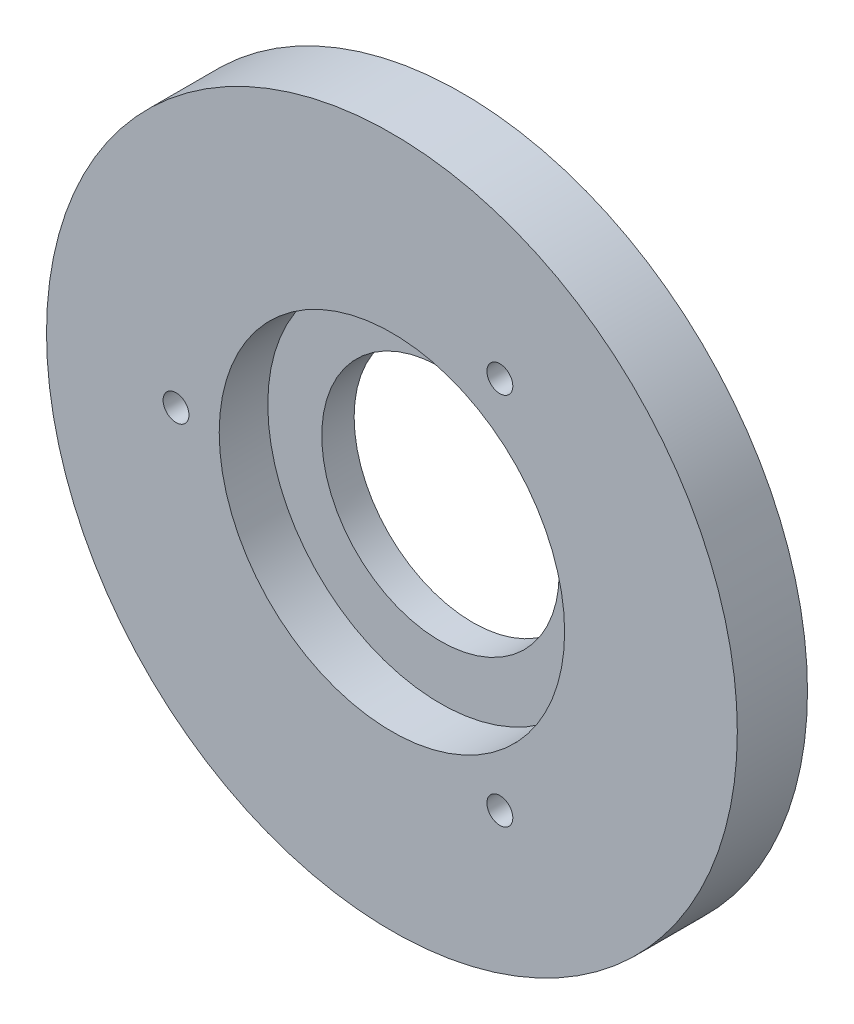
ISO-10303-21;
HEADER;
FILE_DESCRIPTION(('STEP AP214'),'2;1');
FILE_NAME('part.step','',(''),(''),'','','');
FILE_SCHEMA(('AUTOMOTIVE_DESIGN { 1 0 10303 214 1 1 1 1 }'));
ENDSEC;
DATA;
#1=APPLICATION_CONTEXT('core data for automotive mechanical design processes');
#2=APPLICATION_PROTOCOL_DEFINITION('international standard','automotive_design',2000,#1);
#3=PRODUCT_CONTEXT('',#1,'mechanical');
#4=PRODUCT('Part','Part','',(#3));
#5=PRODUCT_RELATED_PRODUCT_CATEGORY('part','',(#4));
#6=PRODUCT_DEFINITION_FORMATION('','',#4);
#7=PRODUCT_DEFINITION_CONTEXT('part definition',#1,'design');
#8=PRODUCT_DEFINITION('design','',#6,#7);
#9=PRODUCT_DEFINITION_SHAPE('','',#8);
#10=(LENGTH_UNIT() NAMED_UNIT(*) SI_UNIT(.MILLI.,.METRE.));
#11=(NAMED_UNIT(*) PLANE_ANGLE_UNIT() SI_UNIT($,.RADIAN.));
#12=(NAMED_UNIT(*) SI_UNIT($,.STERADIAN.) SOLID_ANGLE_UNIT());
#13=UNCERTAINTY_MEASURE_WITH_UNIT(LENGTH_MEASURE(1.E-05),#10,'distance_accuracy_value','');
#14=(GEOMETRIC_REPRESENTATION_CONTEXT(3) GLOBAL_UNCERTAINTY_ASSIGNED_CONTEXT((#13)) GLOBAL_UNIT_ASSIGNED_CONTEXT((#10,
#11,#12)) REPRESENTATION_CONTEXT('',''));
#15=CARTESIAN_POINT('',(0.,0.,0.));
#16=DIRECTION('',(0.,0.,1.));
#17=DIRECTION('',(1.,0.,0.));
#18=AXIS2_PLACEMENT_3D('',#15,#16,#17);
#19=CARTESIAN_POINT('',(0.,0.,9.5));
#20=DIRECTION('',(0.,0.,-1.));
#21=DIRECTION('',(-1.,0.,0.));
#22=AXIS2_PLACEMENT_3D('',#19,#20,#21);
#23=CYLINDRICAL_SURFACE('',#22,6.);
#24=CARTESIAN_POINT('',(0.,0.,9.5));
#25=DIRECTION('',(0.,0.,1.));
#26=DIRECTION('',(1.,0.,0.));
#27=AXIS2_PLACEMENT_3D('',#24,#25,#26);
#28=CIRCLE('',#27,6.);
#29=CARTESIAN_POINT('',(6.,0.,9.5));
#30=VERTEX_POINT('',#29);
#31=EDGE_CURVE('E10',#30,#30,#28,.T.);
#32=ORIENTED_EDGE('',*,*,#31,.F.);
#33=EDGE_LOOP('',(#32));
#34=FACE_BOUND('',#33,.T.);
#35=CARTESIAN_POINT('',(0.,0.,9.));
#36=DIRECTION('',(0.,0.,-1.));
#37=DIRECTION('',(-1.,0.,0.));
#38=AXIS2_PLACEMENT_3D('',#35,#36,#37);
#39=CIRCLE('',#38,6.);
#40=CARTESIAN_POINT('',(-6.,0.,9.));
#41=VERTEX_POINT('',#40);
#42=EDGE_CURVE('E63',#41,#41,#39,.T.);
#43=ORIENTED_EDGE('',*,*,#42,.F.);
#44=EDGE_LOOP('',(#43));
#45=FACE_BOUND('',#44,.T.);
#46=ADVANCED_FACE('F36',(#34,#45),#23,.T.);
#47=CARTESIAN_POINT('',(0.,0.,12.75));
#48=DIRECTION('',(0.,0.,-1.));
#49=DIRECTION('',(-1.,0.,0.));
#50=AXIS2_PLACEMENT_3D('',#47,#48,#49);
#51=CYLINDRICAL_SURFACE('',#50,16.);
#52=CARTESIAN_POINT('',(0.,0.,12.75));
#53=DIRECTION('',(0.,0.,1.));
#54=DIRECTION('',(1.,0.,0.));
#55=AXIS2_PLACEMENT_3D('',#52,#53,#54);
#56=CIRCLE('',#55,16.);
#57=CARTESIAN_POINT('',(16.,0.,12.75));
#58=VERTEX_POINT('',#57);
#59=EDGE_CURVE('E43',#58,#58,#56,.T.);
#60=ORIENTED_EDGE('',*,*,#59,.F.);
#61=EDGE_LOOP('',(#60));
#62=FACE_BOUND('',#61,.T.);
#63=CARTESIAN_POINT('',(0.,0.,9.5));
#64=DIRECTION('',(0.,0.,1.));
#65=DIRECTION('',(1.,0.,0.));
#66=AXIS2_PLACEMENT_3D('',#63,#64,#65);
#67=CIRCLE('',#66,16.);
#68=CARTESIAN_POINT('',(16.,0.,9.5));
#69=VERTEX_POINT('',#68);
#70=EDGE_CURVE('E47',#69,#69,#67,.T.);
#71=ORIENTED_EDGE('',*,*,#70,.T.);
#72=EDGE_LOOP('',(#71));
#73=FACE_BOUND('',#72,.T.);
#74=ADVANCED_FACE('F96',(#62,#73),#51,.T.);
#75=CARTESIAN_POINT('',(0.,0.,12.75));
#76=DIRECTION('',(0.,0.,1.));
#77=DIRECTION('',(1.,0.,0.));
#78=AXIS2_PLACEMENT_3D('',#75,#76,#77);
#79=PLANE('',#78);
#80=CARTESIAN_POINT('',(4.99999999999998,-8.6602540378444,12.75));
#81=DIRECTION('',(0.,0.,1.));
#82=DIRECTION('',(1.,0.,0.));
#83=AXIS2_PLACEMENT_3D('',#80,#81,#82);
#84=CIRCLE('',#83,0.6);
#85=CARTESIAN_POINT('',(5.59999999999998,-8.6602540378444,12.75));
#86=VERTEX_POINT('',#85);
#87=EDGE_CURVE('E72',#86,#86,#84,.T.);
#88=ORIENTED_EDGE('',*,*,#87,.F.);
#89=EDGE_LOOP('',(#88));
#90=FACE_BOUND('',#89,.T.);
#91=CARTESIAN_POINT('',(4.99999999999998,8.6602540378444,12.75));
#92=DIRECTION('',(0.,0.,1.));
#93=DIRECTION('',(1.,0.,0.));
#94=AXIS2_PLACEMENT_3D('',#91,#92,#93);
#95=CIRCLE('',#94,0.6);
#96=CARTESIAN_POINT('',(5.59999999999998,8.6602540378444,12.75));
#97=VERTEX_POINT('',#96);
#98=EDGE_CURVE('E66',#97,#97,#95,.T.);
#99=ORIENTED_EDGE('',*,*,#98,.F.);
#100=EDGE_LOOP('',(#99));
#101=FACE_BOUND('',#100,.T.);
#102=CARTESIAN_POINT('',(-10.,0.,12.75));
#103=DIRECTION('',(0.,0.,1.));
#104=DIRECTION('',(1.,0.,0.));
#105=AXIS2_PLACEMENT_3D('',#102,#103,#104);
#106=CIRCLE('',#105,0.6);
#107=CARTESIAN_POINT('',(-9.4,0.,12.75));
#108=VERTEX_POINT('',#107);
#109=EDGE_CURVE('E59',#108,#108,#106,.T.);
#110=ORIENTED_EDGE('',*,*,#109,.F.);
#111=EDGE_LOOP('',(#110));
#112=FACE_BOUND('',#111,.T.);
#113=CARTESIAN_POINT('',(0.,0.,12.75));
#114=DIRECTION('',(0.,0.,1.));
#115=DIRECTION('',(1.,0.,0.));
#116=AXIS2_PLACEMENT_3D('',#113,#114,#115);
#117=CIRCLE('',#116,8.);
#118=CARTESIAN_POINT('',(8.,0.,12.75));
#119=VERTEX_POINT('',#118);
#120=EDGE_CURVE('E53',#119,#119,#117,.T.);
#121=ORIENTED_EDGE('',*,*,#120,.F.);
#122=EDGE_LOOP('',(#121));
#123=FACE_BOUND('',#122,.T.);
#124=ORIENTED_EDGE('',*,*,#59,.T.);
#125=EDGE_LOOP('',(#124));
#126=FACE_BOUND('',#125,.T.);
#127=ADVANCED_FACE('F101',(#90,#101,#112,#123,#126),#79,.T.);
#128=CARTESIAN_POINT('',(0.,0.,9.5));
#129=DIRECTION('',(0.,0.,1.));
#130=DIRECTION('',(1.,0.,0.));
#131=AXIS2_PLACEMENT_3D('',#128,#129,#130);
#132=PLANE('',#131);
#133=ORIENTED_EDGE('',*,*,#31,.T.);
#134=EDGE_LOOP('',(#133));
#135=FACE_BOUND('',#134,.T.);
#136=ORIENTED_EDGE('',*,*,#70,.F.);
#137=EDGE_LOOP('',(#136));
#138=FACE_BOUND('',#137,.T.);
#139=ADVANCED_FACE('F106',(#135,#138),#132,.F.);
#140=CARTESIAN_POINT('',(0.,0.,10.5));
#141=DIRECTION('',(0.,0.,1.));
#142=DIRECTION('',(1.,0.,0.));
#143=AXIS2_PLACEMENT_3D('',#140,#141,#142);
#144=CYLINDRICAL_SURFACE('',#143,8.);
#145=CARTESIAN_POINT('',(0.,0.,10.5));
#146=DIRECTION('',(0.,0.,1.));
#147=DIRECTION('',(1.,0.,0.));
#148=AXIS2_PLACEMENT_3D('',#145,#146,#147);
#149=CIRCLE('',#148,8.);
#150=CARTESIAN_POINT('',(8.,0.,10.5));
#151=VERTEX_POINT('',#150);
#152=EDGE_CURVE('E51',#151,#151,#149,.T.);
#153=ORIENTED_EDGE('',*,*,#152,.F.);
#154=EDGE_LOOP('',(#153));
#155=FACE_BOUND('',#154,.T.);
#156=ORIENTED_EDGE('',*,*,#120,.T.);
#157=EDGE_LOOP('',(#156));
#158=FACE_BOUND('',#157,.T.);
#159=ADVANCED_FACE('F113',(#155,#158),#144,.F.);
#160=CARTESIAN_POINT('',(0.,0.,10.5));
#161=DIRECTION('',(0.,0.,1.));
#162=DIRECTION('',(1.,0.,0.));
#163=AXIS2_PLACEMENT_3D('',#160,#161,#162);
#164=PLANE('',#163);
#165=CARTESIAN_POINT('',(0.,0.,10.5));
#166=DIRECTION('',(0.,0.,1.));
#167=DIRECTION('',(1.,0.,0.));
#168=AXIS2_PLACEMENT_3D('',#165,#166,#167);
#169=CIRCLE('',#168,5.5);
#170=CARTESIAN_POINT('',(5.5,0.,10.5));
#171=VERTEX_POINT('',#170);
#172=EDGE_CURVE('E79',#171,#171,#169,.T.);
#173=ORIENTED_EDGE('',*,*,#172,.F.);
#174=EDGE_LOOP('',(#173));
#175=FACE_BOUND('',#174,.T.);
#176=ORIENTED_EDGE('',*,*,#152,.T.);
#177=EDGE_LOOP('',(#176));
#178=FACE_BOUND('',#177,.T.);
#179=ADVANCED_FACE('F117',(#175,#178),#164,.T.);
#180=CARTESIAN_POINT('',(-10.,0.,9.75));
#181=DIRECTION('',(0.,0.,1.));
#182=DIRECTION('',(1.,0.,0.));
#183=AXIS2_PLACEMENT_3D('',#180,#181,#182);
#184=CYLINDRICAL_SURFACE('',#183,0.6);
#185=CARTESIAN_POINT('',(-10.,0.,9.75));
#186=DIRECTION('',(0.,0.,1.));
#187=DIRECTION('',(1.,0.,0.));
#188=AXIS2_PLACEMENT_3D('',#185,#186,#187);
#189=CIRCLE('',#188,0.6);
#190=CARTESIAN_POINT('',(-9.4,0.,9.75));
#191=VERTEX_POINT('',#190);
#192=EDGE_CURVE('E62',#191,#191,#189,.T.);
#193=ORIENTED_EDGE('',*,*,#192,.F.);
#194=EDGE_LOOP('',(#193));
#195=FACE_BOUND('',#194,.T.);
#196=ORIENTED_EDGE('',*,*,#109,.T.);
#197=EDGE_LOOP('',(#196));
#198=FACE_BOUND('',#197,.T.);
#199=ADVANCED_FACE('F121',(#195,#198),#184,.F.);
#200=CARTESIAN_POINT('',(-10.,0.,9.75));
#201=DIRECTION('',(0.,0.,1.));
#202=DIRECTION('',(1.,0.,0.));
#203=AXIS2_PLACEMENT_3D('',#200,#201,#202);
#204=PLANE('',#203);
#205=ORIENTED_EDGE('',*,*,#192,.T.);
#206=EDGE_LOOP('',(#205));
#207=FACE_BOUND('',#206,.T.);
#208=ADVANCED_FACE('F125',(#207),#204,.T.);
#209=CARTESIAN_POINT('',(4.99999999999998,8.6602540378444,9.75));
#210=DIRECTION('',(0.,0.,1.));
#211=DIRECTION('',(1.,0.,0.));
#212=AXIS2_PLACEMENT_3D('',#209,#210,#211);
#213=CYLINDRICAL_SURFACE('',#212,0.6);
#214=CARTESIAN_POINT('',(4.99999999999998,8.6602540378444,9.75));
#215=DIRECTION('',(0.,0.,1.));
#216=DIRECTION('',(1.,0.,0.));
#217=AXIS2_PLACEMENT_3D('',#214,#215,#216);
#218=CIRCLE('',#217,0.6);
#219=CARTESIAN_POINT('',(5.59999999999998,8.6602540378444,9.75));
#220=VERTEX_POINT('',#219);
#221=EDGE_CURVE('E69',#220,#220,#218,.T.);
#222=ORIENTED_EDGE('',*,*,#221,.F.);
#223=EDGE_LOOP('',(#222));
#224=FACE_BOUND('',#223,.T.);
#225=ORIENTED_EDGE('',*,*,#98,.T.);
#226=EDGE_LOOP('',(#225));
#227=FACE_BOUND('',#226,.T.);
#228=ADVANCED_FACE('F129',(#224,#227),#213,.F.);
#229=CARTESIAN_POINT('',(4.99999999999998,8.6602540378444,9.75));
#230=DIRECTION('',(0.,0.,1.));
#231=DIRECTION('',(1.,0.,0.));
#232=AXIS2_PLACEMENT_3D('',#229,#230,#231);
#233=PLANE('',#232);
#234=ORIENTED_EDGE('',*,*,#221,.T.);
#235=EDGE_LOOP('',(#234));
#236=FACE_BOUND('',#235,.T.);
#237=ADVANCED_FACE('F133',(#236),#233,.T.);
#238=CARTESIAN_POINT('',(4.99999999999998,-8.6602540378444,9.75));
#239=DIRECTION('',(0.,0.,1.));
#240=DIRECTION('',(1.,0.,0.));
#241=AXIS2_PLACEMENT_3D('',#238,#239,#240);
#242=CYLINDRICAL_SURFACE('',#241,0.6);
#243=CARTESIAN_POINT('',(4.99999999999998,-8.6602540378444,9.75));
#244=DIRECTION('',(0.,0.,1.));
#245=DIRECTION('',(1.,0.,0.));
#246=AXIS2_PLACEMENT_3D('',#243,#244,#245);
#247=CIRCLE('',#246,0.6);
#248=CARTESIAN_POINT('',(5.59999999999998,-8.6602540378444,9.75));
#249=VERTEX_POINT('',#248);
#250=EDGE_CURVE('E56',#249,#249,#247,.T.);
#251=ORIENTED_EDGE('',*,*,#250,.F.);
#252=EDGE_LOOP('',(#251));
#253=FACE_BOUND('',#252,.T.);
#254=ORIENTED_EDGE('',*,*,#87,.T.);
#255=EDGE_LOOP('',(#254));
#256=FACE_BOUND('',#255,.T.);
#257=ADVANCED_FACE('F137',(#253,#256),#242,.F.);
#258=CARTESIAN_POINT('',(4.99999999999998,-8.6602540378444,9.75));
#259=DIRECTION('',(0.,0.,1.));
#260=DIRECTION('',(1.,0.,0.));
#261=AXIS2_PLACEMENT_3D('',#258,#259,#260);
#262=PLANE('',#261);
#263=ORIENTED_EDGE('',*,*,#250,.T.);
#264=EDGE_LOOP('',(#263));
#265=FACE_BOUND('',#264,.T.);
#266=ADVANCED_FACE('F91',(#265),#262,.T.);
#267=CARTESIAN_POINT('',(0.,0.,9.));
#268=DIRECTION('',(0.,0.,-1.));
#269=DIRECTION('',(-1.,0.,0.));
#270=AXIS2_PLACEMENT_3D('',#267,#268,#269);
#271=PLANE('',#270);
#272=CARTESIAN_POINT('',(0.,0.,9.));
#273=DIRECTION('',(0.,0.,-1.));
#274=DIRECTION('',(-1.,0.,0.));
#275=AXIS2_PLACEMENT_3D('',#272,#273,#274);
#276=CIRCLE('',#275,5.5);
#277=CARTESIAN_POINT('',(-5.5,0.,9.));
#278=VERTEX_POINT('',#277);
#279=EDGE_CURVE('E39',#278,#278,#276,.T.);
#280=ORIENTED_EDGE('',*,*,#279,.F.);
#281=EDGE_LOOP('',(#280));
#282=FACE_BOUND('',#281,.T.);
#283=ORIENTED_EDGE('',*,*,#42,.T.);
#284=EDGE_LOOP('',(#283));
#285=FACE_BOUND('',#284,.T.);
#286=ADVANCED_FACE('F88',(#282,#285),#271,.T.);
#287=CARTESIAN_POINT('',(0.,0.,6.));
#288=DIRECTION('',(0.,0.,1.));
#289=DIRECTION('',(1.,0.,0.));
#290=AXIS2_PLACEMENT_3D('',#287,#288,#289);
#291=CYLINDRICAL_SURFACE('',#290,5.5);
#292=ORIENTED_EDGE('',*,*,#172,.T.);
#293=EDGE_LOOP('',(#292));
#294=FACE_BOUND('',#293,.T.);
#295=ORIENTED_EDGE('',*,*,#279,.T.);
#296=EDGE_LOOP('',(#295));
#297=FACE_BOUND('',#296,.T.);
#298=ADVANCED_FACE('F86',(#294,#297),#291,.F.);
#299=CLOSED_SHELL('',(#46,#74,#127,#139,#159,#179,#199,#208,#228,#237,#257,#266,#286,#298));
#300=MANIFOLD_SOLID_BREP('B2',#299);
#301=ADVANCED_BREP_SHAPE_REPRESENTATION('',(#18,#300),#14);
#302=SHAPE_DEFINITION_REPRESENTATION(#9,#301);
ENDSEC;
END-ISO-10303-21;
